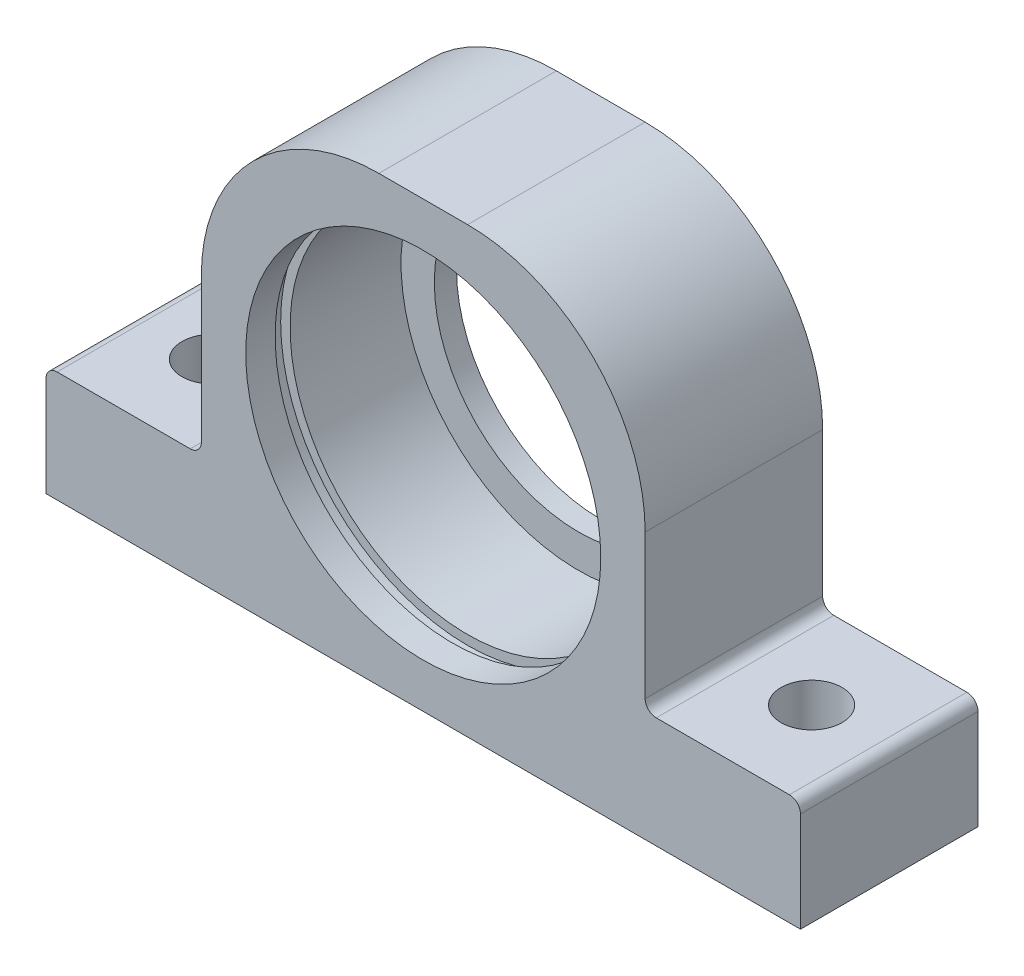
ISO-10303-21;
HEADER;
FILE_DESCRIPTION(('STEP AP214'),'2;1');
FILE_NAME('part.step','',(''),(''),'','','');
FILE_SCHEMA(('AUTOMOTIVE_DESIGN { 1 0 10303 214 1 1 1 1 }'));
ENDSEC;
DATA;
#1=APPLICATION_CONTEXT('core data for automotive mechanical design processes');
#2=APPLICATION_PROTOCOL_DEFINITION('international standard','automotive_design',2000,#1);
#3=PRODUCT_CONTEXT('',#1,'mechanical');
#4=PRODUCT('Part','Part','',(#3));
#5=PRODUCT_RELATED_PRODUCT_CATEGORY('part','',(#4));
#6=PRODUCT_DEFINITION_FORMATION('','',#4);
#7=PRODUCT_DEFINITION_CONTEXT('part definition',#1,'design');
#8=PRODUCT_DEFINITION('design','',#6,#7);
#9=PRODUCT_DEFINITION_SHAPE('','',#8);
#10=(LENGTH_UNIT() NAMED_UNIT(*) SI_UNIT(.MILLI.,.METRE.));
#11=(NAMED_UNIT(*) PLANE_ANGLE_UNIT() SI_UNIT($,.RADIAN.));
#12=(NAMED_UNIT(*) SI_UNIT($,.STERADIAN.) SOLID_ANGLE_UNIT());
#13=UNCERTAINTY_MEASURE_WITH_UNIT(LENGTH_MEASURE(1.E-05),#10,'distance_accuracy_value','');
#14=(GEOMETRIC_REPRESENTATION_CONTEXT(3) GLOBAL_UNCERTAINTY_ASSIGNED_CONTEXT((#13)) GLOBAL_UNIT_ASSIGNED_CONTEXT((#10,
#11,#12)) REPRESENTATION_CONTEXT('',''));
#15=CARTESIAN_POINT('',(0.,0.,0.));
#16=DIRECTION('',(0.,0.,1.));
#17=DIRECTION('',(1.,0.,0.));
#18=AXIS2_PLACEMENT_3D('',#15,#16,#17);
#19=CARTESIAN_POINT('',(-33.0000000000007,9.00000000000068,8.));
#20=DIRECTION('',(0.,0.,-1.));
#21=DIRECTION('',(-1.,0.,0.));
#22=AXIS2_PLACEMENT_3D('',#19,#20,#21);
#23=CYLINDRICAL_SURFACE('',#22,0.99999999999932);
#24=DIRECTION('',(0.,0.,-1.));
#25=VECTOR('',#24,1.);
#26=CARTESIAN_POINT('',(-33.,10.,8.));
#27=LINE('',#26,#25);
#28=CARTESIAN_POINT('',(-33.,10.,8.));
#29=VERTEX_POINT('',#28);
#30=CARTESIAN_POINT('',(-33.,10.,-8.));
#31=VERTEX_POINT('',#30);
#32=EDGE_CURVE('E151',#29,#31,#27,.T.);
#33=ORIENTED_EDGE('',*,*,#32,.T.);
#34=CARTESIAN_POINT('',(-33.0000000000007,9.00000000000068,-8.));
#35=DIRECTION('',(0.,0.,1.));
#36=DIRECTION('',(1.,0.,0.));
#37=AXIS2_PLACEMENT_3D('',#34,#35,#36);
#38=CIRCLE('',#37,0.99999999999932);
#39=CARTESIAN_POINT('',(-34.,9.,-8.));
#40=VERTEX_POINT('',#39);
#41=EDGE_CURVE('E145',#31,#40,#38,.T.);
#42=ORIENTED_EDGE('',*,*,#41,.T.);
#43=DIRECTION('',(0.,0.,-1.));
#44=VECTOR('',#43,1.);
#45=CARTESIAN_POINT('',(-34.,9.,8.));
#46=LINE('',#45,#44);
#47=CARTESIAN_POINT('',(-34.,9.,8.));
#48=VERTEX_POINT('',#47);
#49=EDGE_CURVE('E11',#48,#40,#46,.T.);
#50=ORIENTED_EDGE('',*,*,#49,.F.);
#51=CARTESIAN_POINT('',(-33.0000000000007,9.00000000000068,8.));
#52=DIRECTION('',(0.,0.,1.));
#53=DIRECTION('',(1.,0.,0.));
#54=AXIS2_PLACEMENT_3D('',#51,#52,#53);
#55=CIRCLE('',#54,0.99999999999932);
#56=EDGE_CURVE('E192',#29,#48,#55,.T.);
#57=ORIENTED_EDGE('',*,*,#56,.F.);
#58=EDGE_LOOP('',(#33,#42,#50,#57));
#59=FACE_BOUND('',#58,.T.);
#60=ADVANCED_FACE('F33',(#59),#23,.T.);
#61=CARTESIAN_POINT('',(-34.,9.,8.));
#62=DIRECTION('',(1.,0.,0.));
#63=DIRECTION('',(0.,0.,-1.));
#64=AXIS2_PLACEMENT_3D('',#61,#62,#63);
#65=PLANE('',#64);
#66=ORIENTED_EDGE('',*,*,#49,.T.);
#67=DIRECTION('',(0.,-1.,0.));
#68=VECTOR('',#67,1.);
#69=CARTESIAN_POINT('',(-34.,9.,-8.));
#70=LINE('',#69,#68);
#71=CARTESIAN_POINT('',(-34.,0.,-8.));
#72=VERTEX_POINT('',#71);
#73=EDGE_CURVE('E135',#40,#72,#70,.T.);
#74=ORIENTED_EDGE('',*,*,#73,.T.);
#75=DIRECTION('',(0.,0.,-1.));
#76=VECTOR('',#75,1.);
#77=CARTESIAN_POINT('',(-34.,0.,8.));
#78=LINE('',#77,#76);
#79=CARTESIAN_POINT('',(-34.,0.,8.));
#80=VERTEX_POINT('',#79);
#81=EDGE_CURVE('E40',#80,#72,#78,.T.);
#82=ORIENTED_EDGE('',*,*,#81,.F.);
#83=DIRECTION('',(0.,-1.,0.));
#84=VECTOR('',#83,1.);
#85=CARTESIAN_POINT('',(-34.,9.,8.));
#86=LINE('',#85,#84);
#87=EDGE_CURVE('E136',#48,#80,#86,.T.);
#88=ORIENTED_EDGE('',*,*,#87,.F.);
#89=EDGE_LOOP('',(#66,#74,#82,#88));
#90=FACE_BOUND('',#89,.T.);
#91=ADVANCED_FACE('F133',(#90),#65,.F.);
#92=CARTESIAN_POINT('',(-34.,0.,8.));
#93=DIRECTION('',(0.,1.,0.));
#94=DIRECTION('',(0.,0.,1.));
#95=AXIS2_PLACEMENT_3D('',#92,#93,#94);
#96=PLANE('',#95);
#97=CARTESIAN_POINT('',(-27.,0.,0.));
#98=DIRECTION('',(0.,1.,0.));
#99=DIRECTION('',(0.,0.,1.));
#100=AXIS2_PLACEMENT_3D('',#97,#98,#99);
#101=CIRCLE('',#100,2.75);
#102=CARTESIAN_POINT('',(-27.,0.,2.75));
#103=VERTEX_POINT('',#102);
#104=EDGE_CURVE('E476',#103,#103,#101,.T.);
#105=ORIENTED_EDGE('',*,*,#104,.T.);
#106=EDGE_LOOP('',(#105));
#107=FACE_BOUND('',#106,.T.);
#108=CARTESIAN_POINT('',(27.,0.,0.));
#109=DIRECTION('',(0.,1.,0.));
#110=DIRECTION('',(0.,0.,1.));
#111=AXIS2_PLACEMENT_3D('',#108,#109,#110);
#112=CIRCLE('',#111,2.75);
#113=CARTESIAN_POINT('',(27.,0.,2.75));
#114=VERTEX_POINT('',#113);
#115=EDGE_CURVE('E478',#114,#114,#112,.T.);
#116=ORIENTED_EDGE('',*,*,#115,.T.);
#117=EDGE_LOOP('',(#116));
#118=FACE_BOUND('',#117,.T.);
#119=ORIENTED_EDGE('',*,*,#81,.T.);
#120=DIRECTION('',(1.,0.,0.));
#121=VECTOR('',#120,1.);
#122=CARTESIAN_POINT('',(-34.,0.,-8.));
#123=LINE('',#122,#121);
#124=CARTESIAN_POINT('',(34.,0.,-8.));
#125=VERTEX_POINT('',#124);
#126=EDGE_CURVE('E149',#72,#125,#123,.T.);
#127=ORIENTED_EDGE('',*,*,#126,.T.);
#128=DIRECTION('',(0.,0.,-1.));
#129=VECTOR('',#128,1.);
#130=CARTESIAN_POINT('',(34.,0.,8.));
#131=LINE('',#130,#129);
#132=CARTESIAN_POINT('',(34.,0.,8.));
#133=VERTEX_POINT('',#132);
#134=EDGE_CURVE('E238',#133,#125,#131,.T.);
#135=ORIENTED_EDGE('',*,*,#134,.F.);
#136=DIRECTION('',(1.,0.,0.));
#137=VECTOR('',#136,1.);
#138=CARTESIAN_POINT('',(-34.,0.,8.));
#139=LINE('',#138,#137);
#140=EDGE_CURVE('E195',#80,#133,#139,.T.);
#141=ORIENTED_EDGE('',*,*,#140,.F.);
#142=EDGE_LOOP('',(#119,#127,#135,#141));
#143=FACE_BOUND('',#142,.T.);
#144=ADVANCED_FACE('F241',(#107,#118,#143),#96,.F.);
#145=CARTESIAN_POINT('',(34.,0.,8.));
#146=DIRECTION('',(-1.,0.,0.));
#147=DIRECTION('',(0.,0.,1.));
#148=AXIS2_PLACEMENT_3D('',#145,#146,#147);
#149=PLANE('',#148);
#150=ORIENTED_EDGE('',*,*,#134,.T.);
#151=DIRECTION('',(0.,1.,0.));
#152=VECTOR('',#151,1.);
#153=CARTESIAN_POINT('',(34.,0.,-8.));
#154=LINE('',#153,#152);
#155=CARTESIAN_POINT('',(34.,9.,-8.));
#156=VERTEX_POINT('',#155);
#157=EDGE_CURVE('E160',#125,#156,#154,.T.);
#158=ORIENTED_EDGE('',*,*,#157,.T.);
#159=DIRECTION('',(0.,0.,-1.));
#160=VECTOR('',#159,1.);
#161=CARTESIAN_POINT('',(34.,9.,8.));
#162=LINE('',#161,#160);
#163=CARTESIAN_POINT('',(34.,9.,8.));
#164=VERTEX_POINT('',#163);
#165=EDGE_CURVE('E236',#164,#156,#162,.T.);
#166=ORIENTED_EDGE('',*,*,#165,.F.);
#167=DIRECTION('',(0.,1.,0.));
#168=VECTOR('',#167,1.);
#169=CARTESIAN_POINT('',(34.,0.,8.));
#170=LINE('',#169,#168);
#171=EDGE_CURVE('E197',#133,#164,#170,.T.);
#172=ORIENTED_EDGE('',*,*,#171,.F.);
#173=EDGE_LOOP('',(#150,#158,#166,#172));
#174=FACE_BOUND('',#173,.T.);
#175=ADVANCED_FACE('F249',(#174),#149,.F.);
#176=CARTESIAN_POINT('',(33.0000000000007,9.00000000000068,8.));
#177=DIRECTION('',(0.,0.,-1.));
#178=DIRECTION('',(-1.,0.,0.));
#179=AXIS2_PLACEMENT_3D('',#176,#177,#178);
#180=CYLINDRICAL_SURFACE('',#179,0.99999999999932);
#181=ORIENTED_EDGE('',*,*,#165,.T.);
#182=CARTESIAN_POINT('',(33.0000000000007,9.00000000000068,-8.));
#183=DIRECTION('',(0.,0.,1.));
#184=DIRECTION('',(1.,0.,0.));
#185=AXIS2_PLACEMENT_3D('',#182,#183,#184);
#186=CIRCLE('',#185,0.99999999999932);
#187=CARTESIAN_POINT('',(33.,10.,-8.));
#188=VERTEX_POINT('',#187);
#189=EDGE_CURVE('E163',#156,#188,#186,.T.);
#190=ORIENTED_EDGE('',*,*,#189,.T.);
#191=DIRECTION('',(0.,0.,-1.));
#192=VECTOR('',#191,1.);
#193=CARTESIAN_POINT('',(33.,10.,8.));
#194=LINE('',#193,#192);
#195=CARTESIAN_POINT('',(33.,10.,8.));
#196=VERTEX_POINT('',#195);
#197=EDGE_CURVE('E234',#196,#188,#194,.T.);
#198=ORIENTED_EDGE('',*,*,#197,.F.);
#199=CARTESIAN_POINT('',(33.0000000000007,9.00000000000068,8.));
#200=DIRECTION('',(0.,0.,1.));
#201=DIRECTION('',(1.,0.,0.));
#202=AXIS2_PLACEMENT_3D('',#199,#200,#201);
#203=CIRCLE('',#202,0.99999999999932);
#204=EDGE_CURVE('E199',#164,#196,#203,.T.);
#205=ORIENTED_EDGE('',*,*,#204,.F.);
#206=EDGE_LOOP('',(#181,#190,#198,#205));
#207=FACE_BOUND('',#206,.T.);
#208=ADVANCED_FACE('F252',(#207),#180,.T.);
#209=CARTESIAN_POINT('',(33.,10.,8.));
#210=DIRECTION('',(0.,-1.,0.));
#211=DIRECTION('',(0.,0.,-1.));
#212=AXIS2_PLACEMENT_3D('',#209,#210,#211);
#213=PLANE('',#212);
#214=CARTESIAN_POINT('',(27.,10.,0.));
#215=DIRECTION('',(0.,1.,0.));
#216=DIRECTION('',(0.,0.,1.));
#217=AXIS2_PLACEMENT_3D('',#214,#215,#216);
#218=CIRCLE('',#217,2.75);
#219=CARTESIAN_POINT('',(27.,10.,2.75));
#220=VERTEX_POINT('',#219);
#221=EDGE_CURVE('E483',#220,#220,#218,.T.);
#222=ORIENTED_EDGE('',*,*,#221,.F.);
#223=EDGE_LOOP('',(#222));
#224=FACE_BOUND('',#223,.T.);
#225=ORIENTED_EDGE('',*,*,#197,.T.);
#226=DIRECTION('',(-1.,0.,0.));
#227=VECTOR('',#226,1.);
#228=CARTESIAN_POINT('',(33.,10.,-8.));
#229=LINE('',#228,#227);
#230=CARTESIAN_POINT('',(21.,10.,-8.));
#231=VERTEX_POINT('',#230);
#232=EDGE_CURVE('E166',#188,#231,#229,.T.);
#233=ORIENTED_EDGE('',*,*,#232,.T.);
#234=DIRECTION('',(0.,0.,-1.));
#235=VECTOR('',#234,1.);
#236=CARTESIAN_POINT('',(21.,10.,8.));
#237=LINE('',#236,#235);
#238=CARTESIAN_POINT('',(21.,10.,8.));
#239=VERTEX_POINT('',#238);
#240=EDGE_CURVE('E232',#239,#231,#237,.T.);
#241=ORIENTED_EDGE('',*,*,#240,.F.);
#242=DIRECTION('',(-1.,0.,0.));
#243=VECTOR('',#242,1.);
#244=CARTESIAN_POINT('',(33.,10.,8.));
#245=LINE('',#244,#243);
#246=EDGE_CURVE('E201',#196,#239,#245,.T.);
#247=ORIENTED_EDGE('',*,*,#246,.F.);
#248=EDGE_LOOP('',(#225,#233,#241,#247));
#249=FACE_BOUND('',#248,.T.);
#250=ADVANCED_FACE('F257',(#224,#249),#213,.F.);
#251=CARTESIAN_POINT('',(20.9999999999985,10.9999999999985,8.));
#252=DIRECTION('',(0.,0.,-1.));
#253=DIRECTION('',(-1.,0.,0.));
#254=AXIS2_PLACEMENT_3D('',#251,#252,#253);
#255=CYLINDRICAL_SURFACE('',#254,0.999999999998451);
#256=ORIENTED_EDGE('',*,*,#240,.T.);
#257=CARTESIAN_POINT('',(20.9999999999985,10.9999999999985,-8.));
#258=DIRECTION('',(0.,0.,-1.));
#259=DIRECTION('',(-1.,0.,0.));
#260=AXIS2_PLACEMENT_3D('',#257,#258,#259);
#261=CIRCLE('',#260,0.999999999998451);
#262=CARTESIAN_POINT('',(20.,11.,-8.));
#263=VERTEX_POINT('',#262);
#264=EDGE_CURVE('E169',#231,#263,#261,.T.);
#265=ORIENTED_EDGE('',*,*,#264,.T.);
#266=DIRECTION('',(0.,0.,-1.));
#267=VECTOR('',#266,1.);
#268=CARTESIAN_POINT('',(20.,11.,8.));
#269=LINE('',#268,#267);
#270=CARTESIAN_POINT('',(20.,11.,8.));
#271=VERTEX_POINT('',#270);
#272=EDGE_CURVE('E230',#271,#263,#269,.T.);
#273=ORIENTED_EDGE('',*,*,#272,.F.);
#274=CARTESIAN_POINT('',(20.9999999999985,10.9999999999985,8.));
#275=DIRECTION('',(0.,0.,-1.));
#276=DIRECTION('',(-1.,0.,0.));
#277=AXIS2_PLACEMENT_3D('',#274,#275,#276);
#278=CIRCLE('',#277,0.999999999998451);
#279=EDGE_CURVE('E203',#239,#271,#278,.T.);
#280=ORIENTED_EDGE('',*,*,#279,.F.);
#281=EDGE_LOOP('',(#256,#265,#273,#280));
#282=FACE_BOUND('',#281,.T.);
#283=ADVANCED_FACE('F263',(#282),#255,.F.);
#284=CARTESIAN_POINT('',(20.,11.,8.));
#285=DIRECTION('',(-1.,0.,0.));
#286=DIRECTION('',(0.,0.,1.));
#287=AXIS2_PLACEMENT_3D('',#284,#285,#286);
#288=PLANE('',#287);
#289=ORIENTED_EDGE('',*,*,#272,.T.);
#290=DIRECTION('',(0.,1.,0.));
#291=VECTOR('',#290,1.);
#292=CARTESIAN_POINT('',(20.,11.,-8.));
#293=LINE('',#292,#291);
#294=CARTESIAN_POINT('',(20.,24.,-8.));
#295=VERTEX_POINT('',#294);
#296=EDGE_CURVE('E172',#263,#295,#293,.T.);
#297=ORIENTED_EDGE('',*,*,#296,.T.);
#298=DIRECTION('',(0.,0.,-1.));
#299=VECTOR('',#298,1.);
#300=CARTESIAN_POINT('',(20.,24.,8.));
#301=LINE('',#300,#299);
#302=CARTESIAN_POINT('',(20.,24.,8.));
#303=VERTEX_POINT('',#302);
#304=EDGE_CURVE('E228',#303,#295,#301,.T.);
#305=ORIENTED_EDGE('',*,*,#304,.F.);
#306=DIRECTION('',(0.,1.,0.));
#307=VECTOR('',#306,1.);
#308=CARTESIAN_POINT('',(20.,11.,8.));
#309=LINE('',#308,#307);
#310=EDGE_CURVE('E205',#271,#303,#309,.T.);
#311=ORIENTED_EDGE('',*,*,#310,.F.);
#312=EDGE_LOOP('',(#289,#297,#305,#311));
#313=FACE_BOUND('',#312,.T.);
#314=ADVANCED_FACE('F267',(#313),#288,.F.);
#315=CARTESIAN_POINT('',(4.00000000000081,24.0000000000008,8.));
#316=DIRECTION('',(0.,0.,-1.));
#317=DIRECTION('',(-1.,0.,0.));
#318=AXIS2_PLACEMENT_3D('',#315,#316,#317);
#319=CYLINDRICAL_SURFACE('',#318,15.9999999999992);
#320=ORIENTED_EDGE('',*,*,#304,.T.);
#321=CARTESIAN_POINT('',(4.00000000000081,24.0000000000008,-8.));
#322=DIRECTION('',(0.,0.,1.));
#323=DIRECTION('',(1.,0.,0.));
#324=AXIS2_PLACEMENT_3D('',#321,#322,#323);
#325=CIRCLE('',#324,15.9999999999992);
#326=CARTESIAN_POINT('',(4.,40.,-8.));
#327=VERTEX_POINT('',#326);
#328=EDGE_CURVE('E175',#295,#327,#325,.T.);
#329=ORIENTED_EDGE('',*,*,#328,.T.);
#330=DIRECTION('',(0.,0.,-1.));
#331=VECTOR('',#330,1.);
#332=CARTESIAN_POINT('',(4.,40.,8.));
#333=LINE('',#332,#331);
#334=CARTESIAN_POINT('',(4.,40.,8.));
#335=VERTEX_POINT('',#334);
#336=EDGE_CURVE('E226',#335,#327,#333,.T.);
#337=ORIENTED_EDGE('',*,*,#336,.F.);
#338=CARTESIAN_POINT('',(4.00000000000081,24.0000000000008,8.));
#339=DIRECTION('',(0.,0.,1.));
#340=DIRECTION('',(1.,0.,0.));
#341=AXIS2_PLACEMENT_3D('',#338,#339,#340);
#342=CIRCLE('',#341,15.9999999999992);
#343=EDGE_CURVE('E207',#303,#335,#342,.T.);
#344=ORIENTED_EDGE('',*,*,#343,.F.);
#345=EDGE_LOOP('',(#320,#329,#337,#344));
#346=FACE_BOUND('',#345,.T.);
#347=ADVANCED_FACE('F272',(#346),#319,.T.);
#348=CARTESIAN_POINT('',(4.,40.,8.));
#349=DIRECTION('',(0.,-1.,0.));
#350=DIRECTION('',(0.,0.,-1.));
#351=AXIS2_PLACEMENT_3D('',#348,#349,#350);
#352=PLANE('',#351);
#353=ORIENTED_EDGE('',*,*,#336,.T.);
#354=DIRECTION('',(-1.,0.,0.));
#355=VECTOR('',#354,1.);
#356=CARTESIAN_POINT('',(4.,40.,-8.));
#357=LINE('',#356,#355);
#358=CARTESIAN_POINT('',(-4.,40.,-8.));
#359=VERTEX_POINT('',#358);
#360=EDGE_CURVE('E178',#327,#359,#357,.T.);
#361=ORIENTED_EDGE('',*,*,#360,.T.);
#362=DIRECTION('',(0.,0.,-1.));
#363=VECTOR('',#362,1.);
#364=CARTESIAN_POINT('',(-4.,40.,8.));
#365=LINE('',#364,#363);
#366=CARTESIAN_POINT('',(-4.,40.,8.));
#367=VERTEX_POINT('',#366);
#368=EDGE_CURVE('E224',#367,#359,#365,.T.);
#369=ORIENTED_EDGE('',*,*,#368,.F.);
#370=DIRECTION('',(-1.,0.,0.));
#371=VECTOR('',#370,1.);
#372=CARTESIAN_POINT('',(4.,40.,8.));
#373=LINE('',#372,#371);
#374=EDGE_CURVE('E209',#335,#367,#373,.T.);
#375=ORIENTED_EDGE('',*,*,#374,.F.);
#376=EDGE_LOOP('',(#353,#361,#369,#375));
#377=FACE_BOUND('',#376,.T.);
#378=ADVANCED_FACE('F278',(#377),#352,.F.);
#379=CARTESIAN_POINT('',(-4.00000000000081,24.0000000000008,8.));
#380=DIRECTION('',(0.,0.,-1.));
#381=DIRECTION('',(-1.,0.,0.));
#382=AXIS2_PLACEMENT_3D('',#379,#380,#381);
#383=CYLINDRICAL_SURFACE('',#382,15.9999999999992);
#384=ORIENTED_EDGE('',*,*,#368,.T.);
#385=CARTESIAN_POINT('',(-4.00000000000081,24.0000000000008,-8.));
#386=DIRECTION('',(0.,0.,1.));
#387=DIRECTION('',(1.,0.,0.));
#388=AXIS2_PLACEMENT_3D('',#385,#386,#387);
#389=CIRCLE('',#388,15.9999999999992);
#390=CARTESIAN_POINT('',(-20.,24.,-8.));
#391=VERTEX_POINT('',#390);
#392=EDGE_CURVE('E181',#359,#391,#389,.T.);
#393=ORIENTED_EDGE('',*,*,#392,.T.);
#394=DIRECTION('',(0.,0.,-1.));
#395=VECTOR('',#394,1.);
#396=CARTESIAN_POINT('',(-20.,24.,8.));
#397=LINE('',#396,#395);
#398=CARTESIAN_POINT('',(-20.,24.,8.));
#399=VERTEX_POINT('',#398);
#400=EDGE_CURVE('E222',#399,#391,#397,.T.);
#401=ORIENTED_EDGE('',*,*,#400,.F.);
#402=CARTESIAN_POINT('',(-4.00000000000081,24.0000000000008,8.));
#403=DIRECTION('',(0.,0.,1.));
#404=DIRECTION('',(1.,0.,0.));
#405=AXIS2_PLACEMENT_3D('',#402,#403,#404);
#406=CIRCLE('',#405,15.9999999999992);
#407=EDGE_CURVE('E211',#367,#399,#406,.T.);
#408=ORIENTED_EDGE('',*,*,#407,.F.);
#409=EDGE_LOOP('',(#384,#393,#401,#408));
#410=FACE_BOUND('',#409,.T.);
#411=ADVANCED_FACE('F282',(#410),#383,.T.);
#412=CARTESIAN_POINT('',(-20.,24.,8.));
#413=DIRECTION('',(1.,0.,0.));
#414=DIRECTION('',(0.,0.,-1.));
#415=AXIS2_PLACEMENT_3D('',#412,#413,#414);
#416=PLANE('',#415);
#417=ORIENTED_EDGE('',*,*,#400,.T.);
#418=DIRECTION('',(0.,-1.,0.));
#419=VECTOR('',#418,1.);
#420=CARTESIAN_POINT('',(-20.,24.,-8.));
#421=LINE('',#420,#419);
#422=CARTESIAN_POINT('',(-20.,11.,-8.));
#423=VERTEX_POINT('',#422);
#424=EDGE_CURVE('E184',#391,#423,#421,.T.);
#425=ORIENTED_EDGE('',*,*,#424,.T.);
#426=DIRECTION('',(0.,0.,-1.));
#427=VECTOR('',#426,1.);
#428=CARTESIAN_POINT('',(-20.,11.,8.));
#429=LINE('',#428,#427);
#430=CARTESIAN_POINT('',(-20.,11.,8.));
#431=VERTEX_POINT('',#430);
#432=EDGE_CURVE('E220',#431,#423,#429,.T.);
#433=ORIENTED_EDGE('',*,*,#432,.F.);
#434=DIRECTION('',(0.,-1.,0.));
#435=VECTOR('',#434,1.);
#436=CARTESIAN_POINT('',(-20.,24.,8.));
#437=LINE('',#436,#435);
#438=EDGE_CURVE('E213',#399,#431,#437,.T.);
#439=ORIENTED_EDGE('',*,*,#438,.F.);
#440=EDGE_LOOP('',(#417,#425,#433,#439));
#441=FACE_BOUND('',#440,.T.);
#442=ADVANCED_FACE('F287',(#441),#416,.F.);
#443=CARTESIAN_POINT('',(-20.9999999999985,10.9999999999985,8.));
#444=DIRECTION('',(0.,0.,-1.));
#445=DIRECTION('',(-1.,0.,0.));
#446=AXIS2_PLACEMENT_3D('',#443,#444,#445);
#447=CYLINDRICAL_SURFACE('',#446,0.999999999998451);
#448=ORIENTED_EDGE('',*,*,#432,.T.);
#449=CARTESIAN_POINT('',(-20.9999999999985,10.9999999999985,-8.));
#450=DIRECTION('',(0.,0.,-1.));
#451=DIRECTION('',(-1.,0.,0.));
#452=AXIS2_PLACEMENT_3D('',#449,#450,#451);
#453=CIRCLE('',#452,0.999999999998451);
#454=CARTESIAN_POINT('',(-21.,10.,-8.));
#455=VERTEX_POINT('',#454);
#456=EDGE_CURVE('E187',#423,#455,#453,.T.);
#457=ORIENTED_EDGE('',*,*,#456,.T.);
#458=DIRECTION('',(0.,0.,-1.));
#459=VECTOR('',#458,1.);
#460=CARTESIAN_POINT('',(-21.,10.,8.));
#461=LINE('',#460,#459);
#462=CARTESIAN_POINT('',(-21.,10.,8.));
#463=VERTEX_POINT('',#462);
#464=EDGE_CURVE('E218',#463,#455,#461,.T.);
#465=ORIENTED_EDGE('',*,*,#464,.F.);
#466=CARTESIAN_POINT('',(-20.9999999999985,10.9999999999985,8.));
#467=DIRECTION('',(0.,0.,-1.));
#468=DIRECTION('',(-1.,0.,0.));
#469=AXIS2_PLACEMENT_3D('',#466,#467,#468);
#470=CIRCLE('',#469,0.999999999998451);
#471=EDGE_CURVE('E52',#431,#463,#470,.T.);
#472=ORIENTED_EDGE('',*,*,#471,.F.);
#473=EDGE_LOOP('',(#448,#457,#465,#472));
#474=FACE_BOUND('',#473,.T.);
#475=ADVANCED_FACE('F290',(#474),#447,.F.);
#476=CARTESIAN_POINT('',(-21.,10.,8.));
#477=DIRECTION('',(0.,-1.,0.));
#478=DIRECTION('',(0.,0.,-1.));
#479=AXIS2_PLACEMENT_3D('',#476,#477,#478);
#480=PLANE('',#479);
#481=CARTESIAN_POINT('',(-27.,10.,0.));
#482=DIRECTION('',(0.,1.,0.));
#483=DIRECTION('',(0.,0.,1.));
#484=AXIS2_PLACEMENT_3D('',#481,#482,#483);
#485=CIRCLE('',#484,2.75);
#486=CARTESIAN_POINT('',(-27.,10.,2.75));
#487=VERTEX_POINT('',#486);
#488=EDGE_CURVE('E473',#487,#487,#485,.T.);
#489=ORIENTED_EDGE('',*,*,#488,.F.);
#490=EDGE_LOOP('',(#489));
#491=FACE_BOUND('',#490,.T.);
#492=ORIENTED_EDGE('',*,*,#464,.T.);
#493=DIRECTION('',(-1.,0.,0.));
#494=VECTOR('',#493,1.);
#495=CARTESIAN_POINT('',(-21.,10.,-8.));
#496=LINE('',#495,#494);
#497=EDGE_CURVE('E190',#455,#31,#496,.T.);
#498=ORIENTED_EDGE('',*,*,#497,.T.);
#499=ORIENTED_EDGE('',*,*,#32,.F.);
#500=DIRECTION('',(-1.,0.,0.));
#501=VECTOR('',#500,1.);
#502=CARTESIAN_POINT('',(-21.,10.,8.));
#503=LINE('',#502,#501);
#504=EDGE_CURVE('E47',#463,#29,#503,.T.);
#505=ORIENTED_EDGE('',*,*,#504,.F.);
#506=EDGE_LOOP('',(#492,#498,#499,#505));
#507=FACE_BOUND('',#506,.T.);
#508=ADVANCED_FACE('F292',(#491,#507),#480,.F.);
#509=CARTESIAN_POINT('',(-33.0000000000007,9.00000000000068,8.));
#510=DIRECTION('',(0.,0.,1.));
#511=DIRECTION('',(1.,0.,0.));
#512=AXIS2_PLACEMENT_3D('',#509,#510,#511);
#513=PLANE('',#512);
#514=CARTESIAN_POINT('',(0.,20.,8.));
#515=DIRECTION('',(0.,0.,1.));
#516=DIRECTION('',(1.,0.,0.));
#517=AXIS2_PLACEMENT_3D('',#514,#515,#516);
#518=CIRCLE('',#517,16.);
#519=CARTESIAN_POINT('',(16.,20.,8.));
#520=VERTEX_POINT('',#519);
#521=EDGE_CURVE('E152',#520,#520,#518,.T.);
#522=ORIENTED_EDGE('',*,*,#521,.F.);
#523=EDGE_LOOP('',(#522));
#524=FACE_BOUND('',#523,.T.);
#525=ORIENTED_EDGE('',*,*,#56,.T.);
#526=ORIENTED_EDGE('',*,*,#87,.T.);
#527=ORIENTED_EDGE('',*,*,#140,.T.);
#528=ORIENTED_EDGE('',*,*,#171,.T.);
#529=ORIENTED_EDGE('',*,*,#204,.T.);
#530=ORIENTED_EDGE('',*,*,#246,.T.);
#531=ORIENTED_EDGE('',*,*,#279,.T.);
#532=ORIENTED_EDGE('',*,*,#310,.T.);
#533=ORIENTED_EDGE('',*,*,#343,.T.);
#534=ORIENTED_EDGE('',*,*,#374,.T.);
#535=ORIENTED_EDGE('',*,*,#407,.T.);
#536=ORIENTED_EDGE('',*,*,#438,.T.);
#537=ORIENTED_EDGE('',*,*,#471,.T.);
#538=ORIENTED_EDGE('',*,*,#504,.T.);
#539=EDGE_LOOP('',(#525,#526,#527,#528,#529,#530,#531,#532,#533,#534,#535,#536,#537,#538));
#540=FACE_BOUND('',#539,.T.);
#541=ADVANCED_FACE('F244',(#524,#540),#513,.T.);
#542=CARTESIAN_POINT('',(-33.0000000000007,9.00000000000068,-8.));
#543=DIRECTION('',(0.,0.,1.));
#544=DIRECTION('',(1.,0.,0.));
#545=AXIS2_PLACEMENT_3D('',#542,#543,#544);
#546=PLANE('',#545);
#547=CARTESIAN_POINT('',(0.,20.,-8.));
#548=DIRECTION('',(0.,0.,1.));
#549=DIRECTION('',(1.,0.,0.));
#550=AXIS2_PLACEMENT_3D('',#547,#548,#549);
#551=CIRCLE('',#550,13.);
#552=CARTESIAN_POINT('',(13.,20.,-8.));
#553=VERTEX_POINT('',#552);
#554=EDGE_CURVE('E486',#553,#553,#551,.T.);
#555=ORIENTED_EDGE('',*,*,#554,.T.);
#556=EDGE_LOOP('',(#555));
#557=FACE_BOUND('',#556,.T.);
#558=ORIENTED_EDGE('',*,*,#41,.F.);
#559=ORIENTED_EDGE('',*,*,#497,.F.);
#560=ORIENTED_EDGE('',*,*,#456,.F.);
#561=ORIENTED_EDGE('',*,*,#424,.F.);
#562=ORIENTED_EDGE('',*,*,#392,.F.);
#563=ORIENTED_EDGE('',*,*,#360,.F.);
#564=ORIENTED_EDGE('',*,*,#328,.F.);
#565=ORIENTED_EDGE('',*,*,#296,.F.);
#566=ORIENTED_EDGE('',*,*,#264,.F.);
#567=ORIENTED_EDGE('',*,*,#232,.F.);
#568=ORIENTED_EDGE('',*,*,#189,.F.);
#569=ORIENTED_EDGE('',*,*,#157,.F.);
#570=ORIENTED_EDGE('',*,*,#126,.F.);
#571=ORIENTED_EDGE('',*,*,#73,.F.);
#572=EDGE_LOOP('',(#558,#559,#560,#561,#562,#563,#564,#565,#566,#567,#568,#569,#570,#571));
#573=FACE_BOUND('',#572,.T.);
#574=ADVANCED_FACE('F143',(#557,#573),#546,.F.);
#575=CARTESIAN_POINT('',(0.,20.,-8.));
#576=DIRECTION('',(0.,0.,1.));
#577=DIRECTION('',(1.,0.,0.));
#578=AXIS2_PLACEMENT_3D('',#575,#576,#577);
#579=CYLINDRICAL_SURFACE('',#578,16.);
#580=ORIENTED_EDGE('',*,*,#521,.T.);
#581=EDGE_LOOP('',(#580));
#582=FACE_BOUND('',#581,.T.);
#583=CARTESIAN_POINT('',(0.,20.,5.35));
#584=DIRECTION('',(0.,0.,1.));
#585=DIRECTION('',(1.,0.,0.));
#586=AXIS2_PLACEMENT_3D('',#583,#584,#585);
#587=CIRCLE('',#586,16.);
#588=CARTESIAN_POINT('',(16.,20.,5.35));
#589=VERTEX_POINT('',#588);
#590=EDGE_CURVE('E155',#589,#589,#587,.T.);
#591=ORIENTED_EDGE('',*,*,#590,.F.);
#592=EDGE_LOOP('',(#591));
#593=FACE_BOUND('',#592,.T.);
#594=ADVANCED_FACE('F358',(#582,#593),#579,.F.);
#595=CARTESIAN_POINT('',(0.,36.,5.35));
#596=DIRECTION('',(0.,0.,-1.));
#597=DIRECTION('',(-1.,0.,0.));
#598=AXIS2_PLACEMENT_3D('',#595,#596,#597);
#599=PLANE('',#598);
#600=ORIENTED_EDGE('',*,*,#590,.T.);
#601=EDGE_LOOP('',(#600));
#602=FACE_BOUND('',#601,.T.);
#603=CARTESIAN_POINT('',(0.,20.,5.35));
#604=DIRECTION('',(0.,0.,1.));
#605=DIRECTION('',(1.,0.,0.));
#606=AXIS2_PLACEMENT_3D('',#603,#604,#605);
#607=CIRCLE('',#606,16.85);
#608=CARTESIAN_POINT('',(16.85,20.,5.35));
#609=VERTEX_POINT('',#608);
#610=EDGE_CURVE('E501',#609,#609,#607,.T.);
#611=ORIENTED_EDGE('',*,*,#610,.F.);
#612=EDGE_LOOP('',(#611));
#613=FACE_BOUND('',#612,.T.);
#614=ADVANCED_FACE('F368',(#602,#613),#599,.T.);
#615=CARTESIAN_POINT('',(0.,20.,-8.));
#616=DIRECTION('',(0.,0.,1.));
#617=DIRECTION('',(1.,0.,0.));
#618=AXIS2_PLACEMENT_3D('',#615,#616,#617);
#619=CYLINDRICAL_SURFACE('',#618,16.85);
#620=ORIENTED_EDGE('',*,*,#610,.T.);
#621=EDGE_LOOP('',(#620));
#622=FACE_BOUND('',#621,.T.);
#623=CARTESIAN_POINT('',(0.,20.,4.));
#624=DIRECTION('',(0.,0.,1.));
#625=DIRECTION('',(1.,0.,0.));
#626=AXIS2_PLACEMENT_3D('',#623,#624,#625);
#627=CIRCLE('',#626,16.85);
#628=CARTESIAN_POINT('',(16.85,20.,4.));
#629=VERTEX_POINT('',#628);
#630=EDGE_CURVE('E498',#629,#629,#627,.T.);
#631=ORIENTED_EDGE('',*,*,#630,.F.);
#632=EDGE_LOOP('',(#631));
#633=FACE_BOUND('',#632,.T.);
#634=ADVANCED_FACE('F378',(#622,#633),#619,.F.);
#635=CARTESIAN_POINT('',(0.,36.85,4.));
#636=DIRECTION('',(0.,0.,1.));
#637=DIRECTION('',(1.,0.,0.));
#638=AXIS2_PLACEMENT_3D('',#635,#636,#637);
#639=PLANE('',#638);
#640=ORIENTED_EDGE('',*,*,#630,.T.);
#641=EDGE_LOOP('',(#640));
#642=FACE_BOUND('',#641,.T.);
#643=CARTESIAN_POINT('',(0.,20.,4.));
#644=DIRECTION('',(0.,0.,1.));
#645=DIRECTION('',(1.,0.,0.));
#646=AXIS2_PLACEMENT_3D('',#643,#644,#645);
#647=CIRCLE('',#646,16.);
#648=CARTESIAN_POINT('',(16.,20.,4.));
#649=VERTEX_POINT('',#648);
#650=EDGE_CURVE('E495',#649,#649,#647,.T.);
#651=ORIENTED_EDGE('',*,*,#650,.F.);
#652=EDGE_LOOP('',(#651));
#653=FACE_BOUND('',#652,.T.);
#654=ADVANCED_FACE('F388',(#642,#653),#639,.T.);
#655=CARTESIAN_POINT('',(0.,20.,-8.));
#656=DIRECTION('',(0.,0.,1.));
#657=DIRECTION('',(1.,0.,0.));
#658=AXIS2_PLACEMENT_3D('',#655,#656,#657);
#659=CYLINDRICAL_SURFACE('',#658,16.);
#660=ORIENTED_EDGE('',*,*,#650,.T.);
#661=EDGE_LOOP('',(#660));
#662=FACE_BOUND('',#661,.T.);
#663=CARTESIAN_POINT('',(0.,20.,-6.));
#664=DIRECTION('',(0.,0.,1.));
#665=DIRECTION('',(1.,0.,0.));
#666=AXIS2_PLACEMENT_3D('',#663,#664,#665);
#667=CIRCLE('',#666,16.);
#668=CARTESIAN_POINT('',(16.,20.,-6.));
#669=VERTEX_POINT('',#668);
#670=EDGE_CURVE('E492',#669,#669,#667,.T.);
#671=ORIENTED_EDGE('',*,*,#670,.F.);
#672=EDGE_LOOP('',(#671));
#673=FACE_BOUND('',#672,.T.);
#674=ADVANCED_FACE('F398',(#662,#673),#659,.F.);
#675=CARTESIAN_POINT('',(0.,36.,-6.));
#676=DIRECTION('',(0.,0.,1.));
#677=DIRECTION('',(1.,0.,0.));
#678=AXIS2_PLACEMENT_3D('',#675,#676,#677);
#679=PLANE('',#678);
#680=ORIENTED_EDGE('',*,*,#670,.T.);
#681=EDGE_LOOP('',(#680));
#682=FACE_BOUND('',#681,.T.);
#683=CARTESIAN_POINT('',(0.,20.,-6.));
#684=DIRECTION('',(0.,0.,1.));
#685=DIRECTION('',(1.,0.,0.));
#686=AXIS2_PLACEMENT_3D('',#683,#684,#685);
#687=CIRCLE('',#686,13.);
#688=CARTESIAN_POINT('',(13.,20.,-6.));
#689=VERTEX_POINT('',#688);
#690=EDGE_CURVE('E489',#689,#689,#687,.T.);
#691=ORIENTED_EDGE('',*,*,#690,.F.);
#692=EDGE_LOOP('',(#691));
#693=FACE_BOUND('',#692,.T.);
#694=ADVANCED_FACE('F408',(#682,#693),#679,.T.);
#695=CARTESIAN_POINT('',(0.,20.,-8.));
#696=DIRECTION('',(0.,0.,1.));
#697=DIRECTION('',(1.,0.,0.));
#698=AXIS2_PLACEMENT_3D('',#695,#696,#697);
#699=CYLINDRICAL_SURFACE('',#698,13.);
#700=ORIENTED_EDGE('',*,*,#690,.T.);
#701=EDGE_LOOP('',(#700));
#702=FACE_BOUND('',#701,.T.);
#703=ORIENTED_EDGE('',*,*,#554,.F.);
#704=EDGE_LOOP('',(#703));
#705=FACE_BOUND('',#704,.T.);
#706=ADVANCED_FACE('F418',(#702,#705),#699,.F.);
#707=CARTESIAN_POINT('',(27.,0.,0.));
#708=DIRECTION('',(0.,1.,0.));
#709=DIRECTION('',(0.,0.,1.));
#710=AXIS2_PLACEMENT_3D('',#707,#708,#709);
#711=CYLINDRICAL_SURFACE('',#710,2.75);
#712=ORIENTED_EDGE('',*,*,#221,.T.);
#713=EDGE_LOOP('',(#712));
#714=FACE_BOUND('',#713,.T.);
#715=ORIENTED_EDGE('',*,*,#115,.F.);
#716=EDGE_LOOP('',(#715));
#717=FACE_BOUND('',#716,.T.);
#718=ADVANCED_FACE('F428',(#714,#717),#711,.F.);
#719=CARTESIAN_POINT('',(-27.,0.,0.));
#720=DIRECTION('',(0.,1.,0.));
#721=DIRECTION('',(0.,0.,1.));
#722=AXIS2_PLACEMENT_3D('',#719,#720,#721);
#723=CYLINDRICAL_SURFACE('',#722,2.75);
#724=ORIENTED_EDGE('',*,*,#488,.T.);
#725=EDGE_LOOP('',(#724));
#726=FACE_BOUND('',#725,.T.);
#727=ORIENTED_EDGE('',*,*,#104,.F.);
#728=EDGE_LOOP('',(#727));
#729=FACE_BOUND('',#728,.T.);
#730=ADVANCED_FACE('F446',(#726,#729),#723,.F.);
#731=CLOSED_SHELL('',(#60,#91,#144,#175,#208,#250,#283,#314,#347,#378,#411,#442,#475,#508,#541,
#574,#594,#614,#634,#654,#674,#694,#706,#718,#730));
#732=MANIFOLD_SOLID_BREP('B2',#731);
#733=ADVANCED_BREP_SHAPE_REPRESENTATION('',(#18,#732),#14);
#734=SHAPE_DEFINITION_REPRESENTATION(#9,#733);
ENDSEC;
END-ISO-10303-21;
